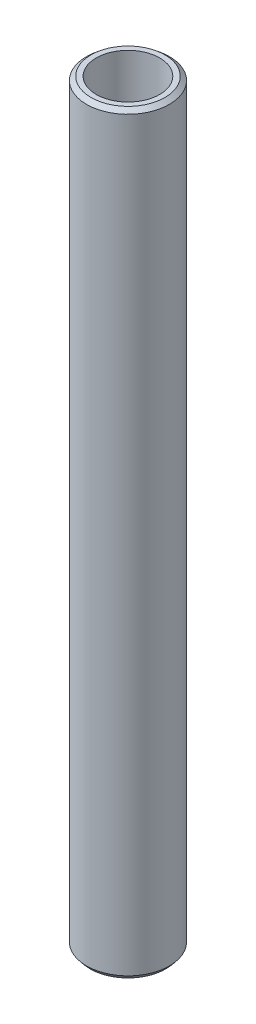
ISO-10303-21;
HEADER;
FILE_DESCRIPTION(('STEP AP214'),'2;1');
FILE_NAME('part.step','',(''),(''),'','','');
FILE_SCHEMA(('AUTOMOTIVE_DESIGN { 1 0 10303 214 1 1 1 1 }'));
ENDSEC;
DATA;
#1=APPLICATION_CONTEXT('core data for automotive mechanical design processes');
#2=APPLICATION_PROTOCOL_DEFINITION('international standard','automotive_design',2000,#1);
#3=PRODUCT_CONTEXT('',#1,'mechanical');
#4=PRODUCT('Part','Part','',(#3));
#5=PRODUCT_RELATED_PRODUCT_CATEGORY('part','',(#4));
#6=PRODUCT_DEFINITION_FORMATION('','',#4);
#7=PRODUCT_DEFINITION_CONTEXT('part definition',#1,'design');
#8=PRODUCT_DEFINITION('design','',#6,#7);
#9=PRODUCT_DEFINITION_SHAPE('','',#8);
#10=(LENGTH_UNIT() NAMED_UNIT(*) SI_UNIT(.MILLI.,.METRE.));
#11=(NAMED_UNIT(*) PLANE_ANGLE_UNIT() SI_UNIT($,.RADIAN.));
#12=(NAMED_UNIT(*) SI_UNIT($,.STERADIAN.) SOLID_ANGLE_UNIT());
#13=UNCERTAINTY_MEASURE_WITH_UNIT(LENGTH_MEASURE(1.E-05),#10,'distance_accuracy_value','');
#14=(GEOMETRIC_REPRESENTATION_CONTEXT(3) GLOBAL_UNCERTAINTY_ASSIGNED_CONTEXT((#13)) GLOBAL_UNIT_ASSIGNED_CONTEXT((#10,
#11,#12)) REPRESENTATION_CONTEXT('',''));
#15=CARTESIAN_POINT('',(0.,0.,0.));
#16=DIRECTION('',(0.,0.,1.));
#17=DIRECTION('',(1.,0.,0.));
#18=AXIS2_PLACEMENT_3D('',#15,#16,#17);
#19=CARTESIAN_POINT('',(0.,546.041719603958,0.));
#20=DIRECTION('',(0.,-1.,0.));
#21=DIRECTION('',(0.,0.,-1.));
#22=AXIS2_PLACEMENT_3D('',#19,#20,#21);
#23=CYLINDRICAL_SURFACE('',#22,30.);
#24=CARTESIAN_POINT('',(0.,543.361896640867,0.));
#25=DIRECTION('',(0.,1.,0.));
#26=DIRECTION('',(0.,0.,1.));
#27=AXIS2_PLACEMENT_3D('',#24,#25,#26);
#28=CIRCLE('',#27,30.);
#29=CARTESIAN_POINT('',(0.,543.361896640867,30.));
#30=VERTEX_POINT('',#29);
#31=EDGE_CURVE('E50',#30,#30,#28,.F.);
#32=ORIENTED_EDGE('',*,*,#31,.T.);
#33=EDGE_LOOP('',(#32));
#34=FACE_BOUND('',#33,.T.);
#35=CARTESIAN_POINT('',(0.,3.23894638820255,0.));
#36=DIRECTION('',(0.,1.,0.));
#37=DIRECTION('',(0.,0.,1.));
#38=AXIS2_PLACEMENT_3D('',#35,#36,#37);
#39=CIRCLE('',#38,30.);
#40=CARTESIAN_POINT('',(0.,3.23894638820255,30.));
#41=VERTEX_POINT('',#40);
#42=EDGE_CURVE('E51',#41,#41,#39,.T.);
#43=ORIENTED_EDGE('',*,*,#42,.T.);
#44=EDGE_LOOP('',(#43));
#45=FACE_BOUND('',#44,.T.);
#46=ADVANCED_FACE('F39',(#34,#45),#23,.T.);
#47=CARTESIAN_POINT('',(0.,546.041719603958,0.));
#48=DIRECTION('',(0.,1.,0.));
#49=DIRECTION('',(0.,0.,1.));
#50=AXIS2_PLACEMENT_3D('',#47,#48,#49);
#51=PLANE('',#50);
#52=CARTESIAN_POINT('',(0.,546.041719603958,0.));
#53=DIRECTION('',(0.,1.,0.));
#54=DIRECTION('',(0.,0.,1.));
#55=AXIS2_PLACEMENT_3D('',#52,#53,#54);
#56=CIRCLE('',#55,26.7610536117976);
#57=CARTESIAN_POINT('',(0.,546.041719603958,26.7610536117976));
#58=VERTEX_POINT('',#57);
#59=EDGE_CURVE('E54',#58,#58,#56,.T.);
#60=ORIENTED_EDGE('',*,*,#59,.T.);
#61=EDGE_LOOP('',(#60));
#62=FACE_BOUND('',#61,.T.);
#63=CARTESIAN_POINT('',(0.,546.041719603958,0.));
#64=DIRECTION('',(0.,1.,0.));
#65=DIRECTION('',(0.,0.,1.));
#66=AXIS2_PLACEMENT_3D('',#63,#64,#65);
#67=CIRCLE('',#66,22.9618184066322);
#68=CARTESIAN_POINT('',(0.,546.041719603958,22.9618184066322));
#69=VERTEX_POINT('',#68);
#70=EDGE_CURVE('E58',#69,#69,#67,.T.);
#71=ORIENTED_EDGE('',*,*,#70,.F.);
#72=EDGE_LOOP('',(#71));
#73=FACE_BOUND('',#72,.T.);
#74=ADVANCED_FACE('F69',(#62,#73),#51,.T.);
#75=CARTESIAN_POINT('',(0.,0.,0.));
#76=DIRECTION('',(0.,1.,0.));
#77=DIRECTION('',(0.,0.,1.));
#78=AXIS2_PLACEMENT_3D('',#75,#76,#77);
#79=PLANE('',#78);
#80=CARTESIAN_POINT('',(0.,0.,0.));
#81=DIRECTION('',(0.,1.,0.));
#82=DIRECTION('',(0.,0.,1.));
#83=AXIS2_PLACEMENT_3D('',#80,#81,#82);
#84=CIRCLE('',#83,27.3201770369094);
#85=CARTESIAN_POINT('',(0.,0.,27.3201770369094));
#86=VERTEX_POINT('',#85);
#87=EDGE_CURVE('E10',#86,#86,#84,.F.);
#88=ORIENTED_EDGE('',*,*,#87,.T.);
#89=EDGE_LOOP('',(#88));
#90=FACE_BOUND('',#89,.T.);
#91=CARTESIAN_POINT('',(0.,0.,0.));
#92=DIRECTION('',(0.,1.,0.));
#93=DIRECTION('',(0.,0.,1.));
#94=AXIS2_PLACEMENT_3D('',#91,#92,#93);
#95=CIRCLE('',#94,22.9618184066322);
#96=CARTESIAN_POINT('',(0.,0.,22.9618184066322));
#97=VERTEX_POINT('',#96);
#98=EDGE_CURVE('E63',#97,#97,#95,.T.);
#99=ORIENTED_EDGE('',*,*,#98,.T.);
#100=EDGE_LOOP('',(#99));
#101=FACE_BOUND('',#100,.T.);
#102=ADVANCED_FACE('F75',(#90,#101),#79,.F.);
#103=CARTESIAN_POINT('',(0.,546.041719603958,0.));
#104=DIRECTION('',(0.,-1.,0.));
#105=DIRECTION('',(0.,0.,-1.));
#106=AXIS2_PLACEMENT_3D('',#103,#104,#105);
#107=CYLINDRICAL_SURFACE('',#106,22.9618184066322);
#108=ORIENTED_EDGE('',*,*,#70,.T.);
#109=EDGE_LOOP('',(#108));
#110=FACE_BOUND('',#109,.T.);
#111=ORIENTED_EDGE('',*,*,#98,.F.);
#112=EDGE_LOOP('',(#111));
#113=FACE_BOUND('',#112,.T.);
#114=ADVANCED_FACE('F70',(#110,#113),#107,.F.);
#115=CARTESIAN_POINT('',(0.,546.041719603958,0.));
#116=DIRECTION('',(0.,-1.,0.));
#117=DIRECTION('',(0.,0.,-1.));
#118=AXIS2_PLACEMENT_3D('',#115,#116,#117);
#119=CONICAL_SURFACE('',#118,26.7610536117976,0.879584819760721);
#120=ORIENTED_EDGE('',*,*,#31,.F.);
#121=EDGE_LOOP('',(#120));
#122=FACE_BOUND('',#121,.T.);
#123=ORIENTED_EDGE('',*,*,#59,.F.);
#124=EDGE_LOOP('',(#123));
#125=FACE_BOUND('',#124,.T.);
#126=ADVANCED_FACE('F81',(#122,#125),#119,.T.);
#127=CARTESIAN_POINT('',(0.,3.23894638820255,0.));
#128=DIRECTION('',(0.,1.,0.));
#129=DIRECTION('',(0.,0.,1.));
#130=AXIS2_PLACEMENT_3D('',#127,#128,#129);
#131=CONICAL_SURFACE('',#130,30.,0.691211507034172);
#132=ORIENTED_EDGE('',*,*,#87,.F.);
#133=EDGE_LOOP('',(#132));
#134=FACE_BOUND('',#133,.T.);
#135=ORIENTED_EDGE('',*,*,#42,.F.);
#136=EDGE_LOOP('',(#135));
#137=FACE_BOUND('',#136,.T.);
#138=ADVANCED_FACE('F45',(#134,#137),#131,.T.);
#139=CLOSED_SHELL('',(#46,#74,#102,#114,#126,#138));
#140=MANIFOLD_SOLID_BREP('B2',#139);
#141=ADVANCED_BREP_SHAPE_REPRESENTATION('',(#18,#140),#14);
#142=SHAPE_DEFINITION_REPRESENTATION(#9,#141);
ENDSEC;
END-ISO-10303-21;
